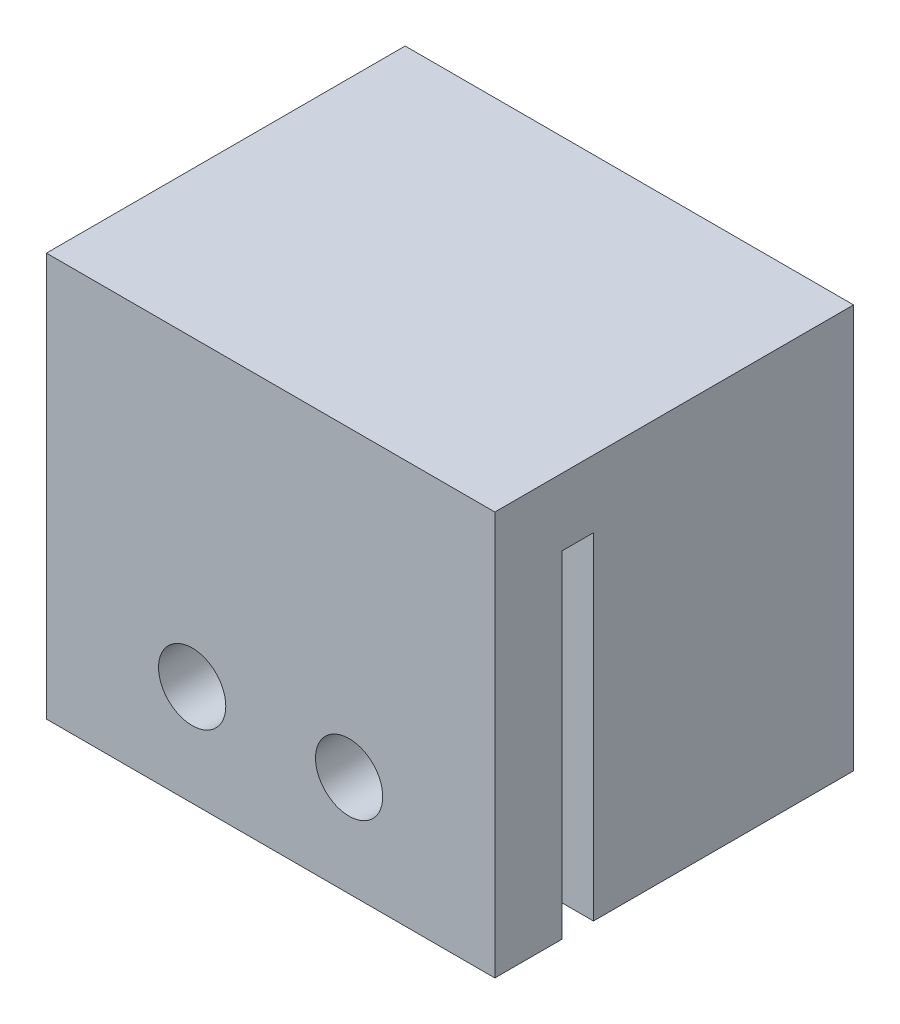
ISO-10303-21;
HEADER;
FILE_DESCRIPTION(('STEP AP214'),'2;1');
FILE_NAME('part.step','',(''),(''),'','','');
FILE_SCHEMA(('AUTOMOTIVE_DESIGN { 1 0 10303 214 1 1 1 1 }'));
ENDSEC;
DATA;
#1=APPLICATION_CONTEXT('core data for automotive mechanical design processes');
#2=APPLICATION_PROTOCOL_DEFINITION('international standard','automotive_design',2000,#1);
#3=PRODUCT_CONTEXT('',#1,'mechanical');
#4=PRODUCT('Part','Part','',(#3));
#5=PRODUCT_RELATED_PRODUCT_CATEGORY('part','',(#4));
#6=PRODUCT_DEFINITION_FORMATION('','',#4);
#7=PRODUCT_DEFINITION_CONTEXT('part definition',#1,'design');
#8=PRODUCT_DEFINITION('design','',#6,#7);
#9=PRODUCT_DEFINITION_SHAPE('','',#8);
#10=(LENGTH_UNIT() NAMED_UNIT(*) SI_UNIT(.MILLI.,.METRE.));
#11=(NAMED_UNIT(*) PLANE_ANGLE_UNIT() SI_UNIT($,.RADIAN.));
#12=(NAMED_UNIT(*) SI_UNIT($,.STERADIAN.) SOLID_ANGLE_UNIT());
#13=UNCERTAINTY_MEASURE_WITH_UNIT(LENGTH_MEASURE(1.E-05),#10,'distance_accuracy_value','');
#14=(GEOMETRIC_REPRESENTATION_CONTEXT(3) GLOBAL_UNCERTAINTY_ASSIGNED_CONTEXT((#13)) GLOBAL_UNIT_ASSIGNED_CONTEXT((#10,
#11,#12)) REPRESENTATION_CONTEXT('',''));
#15=CARTESIAN_POINT('',(0.,0.,0.));
#16=DIRECTION('',(0.,0.,1.));
#17=DIRECTION('',(1.,0.,0.));
#18=AXIS2_PLACEMENT_3D('',#15,#16,#17);
#19=CARTESIAN_POINT('',(-10.,-9.,-16.));
#20=DIRECTION('',(0.,-1.,0.));
#21=DIRECTION('',(0.,0.,-1.));
#22=AXIS2_PLACEMENT_3D('',#19,#20,#21);
#23=PLANE('',#22);
#24=DIRECTION('',(-1.,0.,0.));
#25=VECTOR('',#24,1.);
#26=CARTESIAN_POINT('',(-10.,-9.,-3.));
#27=LINE('',#26,#25);
#28=CARTESIAN_POINT('',(10.,-9.,-3.));
#29=VERTEX_POINT('',#28);
#30=CARTESIAN_POINT('',(-10.,-9.,-3.));
#31=VERTEX_POINT('',#30);
#32=EDGE_CURVE('E157',#29,#31,#27,.T.);
#33=ORIENTED_EDGE('',*,*,#32,.F.);
#34=DIRECTION('',(0.,0.,1.));
#35=VECTOR('',#34,1.);
#36=CARTESIAN_POINT('',(10.,-9.,-16.));
#37=LINE('',#36,#35);
#38=CARTESIAN_POINT('',(10.,-9.,0.));
#39=VERTEX_POINT('',#38);
#40=EDGE_CURVE('E43',#29,#39,#37,.T.);
#41=ORIENTED_EDGE('',*,*,#40,.T.);
#42=DIRECTION('',(1.,0.,0.));
#43=VECTOR('',#42,1.);
#44=CARTESIAN_POINT('',(-10.,-9.,0.));
#45=LINE('',#44,#43);
#46=CARTESIAN_POINT('',(-10.,-9.,0.));
#47=VERTEX_POINT('',#46);
#48=EDGE_CURVE('E198',#47,#39,#45,.T.);
#49=ORIENTED_EDGE('',*,*,#48,.F.);
#50=DIRECTION('',(0.,0.,1.));
#51=VECTOR('',#50,1.);
#52=CARTESIAN_POINT('',(-10.,-9.,-16.));
#53=LINE('',#52,#51);
#54=EDGE_CURVE('E216',#31,#47,#53,.T.);
#55=ORIENTED_EDGE('',*,*,#54,.F.);
#56=EDGE_LOOP('',(#33,#41,#49,#55));
#57=FACE_BOUND('',#56,.T.);
#58=ADVANCED_FACE('F34',(#57),#23,.T.);
#59=DIRECTION('',(1.,0.,0.));
#60=VECTOR('',#59,1.);
#61=CARTESIAN_POINT('',(-10.,-9.,-4.4));
#62=LINE('',#61,#60);
#63=CARTESIAN_POINT('',(-10.,-9.,-4.4));
#64=VERTEX_POINT('',#63);
#65=CARTESIAN_POINT('',(-7.05,-9.,-4.4));
#66=VERTEX_POINT('',#65);
#67=EDGE_CURVE('E225',#64,#66,#62,.T.);
#68=ORIENTED_EDGE('',*,*,#67,.F.);
#69=CARTESIAN_POINT('',(-10.,-9.,-16.));
#70=VERTEX_POINT('',#69);
#71=EDGE_CURVE('E162',#70,#64,#53,.T.);
#72=ORIENTED_EDGE('',*,*,#71,.F.);
#73=DIRECTION('',(1.,0.,0.));
#74=VECTOR('',#73,1.);
#75=CARTESIAN_POINT('',(-10.,-9.,-16.));
#76=LINE('',#75,#74);
#77=CARTESIAN_POINT('',(-7.05,-9.,-16.));
#78=VERTEX_POINT('',#77);
#79=EDGE_CURVE('E202',#70,#78,#76,.T.);
#80=ORIENTED_EDGE('',*,*,#79,.T.);
#81=DIRECTION('',(0.,0.,-1.));
#82=VECTOR('',#81,1.);
#83=CARTESIAN_POINT('',(-7.05,-9.,-16.));
#84=LINE('',#83,#82);
#85=EDGE_CURVE('E179',#66,#78,#84,.T.);
#86=ORIENTED_EDGE('',*,*,#85,.F.);
#87=EDGE_LOOP('',(#68,#72,#80,#86));
#88=FACE_BOUND('',#87,.T.);
#89=ADVANCED_FACE('F260',(#88),#23,.T.);
#90=CARTESIAN_POINT('',(10.,-9.,-16.));
#91=DIRECTION('',(1.,0.,0.));
#92=DIRECTION('',(0.,0.,-1.));
#93=AXIS2_PLACEMENT_3D('',#90,#91,#92);
#94=PLANE('',#93);
#95=DIRECTION('',(0.,-1.,0.));
#96=VECTOR('',#95,1.);
#97=CARTESIAN_POINT('',(10.,6.,-3.));
#98=LINE('',#97,#96);
#99=CARTESIAN_POINT('',(10.,6.,-3.));
#100=VERTEX_POINT('',#99);
#101=EDGE_CURVE('E164',#100,#29,#98,.T.);
#102=ORIENTED_EDGE('',*,*,#101,.F.);
#103=DIRECTION('',(0.,0.,1.));
#104=VECTOR('',#103,1.);
#105=CARTESIAN_POINT('',(10.,6.,-3.));
#106=LINE('',#105,#104);
#107=CARTESIAN_POINT('',(10.,6.,-4.4));
#108=VERTEX_POINT('',#107);
#109=EDGE_CURVE('E147',#108,#100,#106,.T.);
#110=ORIENTED_EDGE('',*,*,#109,.F.);
#111=DIRECTION('',(0.,-1.,0.));
#112=VECTOR('',#111,1.);
#113=CARTESIAN_POINT('',(10.,6.,-4.4));
#114=LINE('',#113,#112);
#115=CARTESIAN_POINT('',(10.,-9.,-4.4));
#116=VERTEX_POINT('',#115);
#117=EDGE_CURVE('E144',#108,#116,#114,.T.);
#118=ORIENTED_EDGE('',*,*,#117,.T.);
#119=CARTESIAN_POINT('',(10.,-9.,-16.));
#120=VERTEX_POINT('',#119);
#121=EDGE_CURVE('E11',#120,#116,#37,.T.);
#122=ORIENTED_EDGE('',*,*,#121,.F.);
#123=DIRECTION('',(0.,1.,0.));
#124=VECTOR('',#123,1.);
#125=CARTESIAN_POINT('',(10.,-9.,-16.));
#126=LINE('',#125,#124);
#127=CARTESIAN_POINT('',(10.,9.,-16.));
#128=VERTEX_POINT('',#127);
#129=EDGE_CURVE('E194',#120,#128,#126,.T.);
#130=ORIENTED_EDGE('',*,*,#129,.T.);
#131=DIRECTION('',(0.,0.,1.));
#132=VECTOR('',#131,1.);
#133=CARTESIAN_POINT('',(10.,9.,-16.));
#134=LINE('',#133,#132);
#135=CARTESIAN_POINT('',(10.,9.,0.));
#136=VERTEX_POINT('',#135);
#137=EDGE_CURVE('E88',#128,#136,#134,.T.);
#138=ORIENTED_EDGE('',*,*,#137,.T.);
#139=DIRECTION('',(0.,1.,0.));
#140=VECTOR('',#139,1.);
#141=CARTESIAN_POINT('',(10.,-9.,0.));
#142=LINE('',#141,#140);
#143=EDGE_CURVE('E187',#39,#136,#142,.T.);
#144=ORIENTED_EDGE('',*,*,#143,.F.);
#145=ORIENTED_EDGE('',*,*,#40,.F.);
#146=EDGE_LOOP('',(#102,#110,#118,#122,#130,#138,#144,#145));
#147=FACE_BOUND('',#146,.T.);
#148=ADVANCED_FACE('F36',(#147),#94,.T.);
#149=CARTESIAN_POINT('',(7.05,-9.,-4.4));
#150=VERTEX_POINT('',#149);
#151=EDGE_CURVE('E221',#150,#116,#62,.T.);
#152=ORIENTED_EDGE('',*,*,#151,.F.);
#153=DIRECTION('',(0.,0.,1.));
#154=VECTOR('',#153,1.);
#155=CARTESIAN_POINT('',(7.05,-9.,-16.));
#156=LINE('',#155,#154);
#157=CARTESIAN_POINT('',(7.05,-9.,-16.));
#158=VERTEX_POINT('',#157);
#159=EDGE_CURVE('E171',#158,#150,#156,.T.);
#160=ORIENTED_EDGE('',*,*,#159,.F.);
#161=EDGE_CURVE('E59',#158,#120,#76,.T.);
#162=ORIENTED_EDGE('',*,*,#161,.T.);
#163=ORIENTED_EDGE('',*,*,#121,.T.);
#164=EDGE_LOOP('',(#152,#160,#162,#163));
#165=FACE_BOUND('',#164,.T.);
#166=ADVANCED_FACE('F257',(#165),#23,.T.);
#167=CARTESIAN_POINT('',(-10.,-9.,-16.));
#168=DIRECTION('',(-1.,0.,0.));
#169=DIRECTION('',(0.,0.,1.));
#170=AXIS2_PLACEMENT_3D('',#167,#168,#169);
#171=PLANE('',#170);
#172=DIRECTION('',(0.,-1.,0.));
#173=VECTOR('',#172,1.);
#174=CARTESIAN_POINT('',(-10.,6.,-3.));
#175=LINE('',#174,#173);
#176=CARTESIAN_POINT('',(-10.,6.,-3.));
#177=VERTEX_POINT('',#176);
#178=EDGE_CURVE('E181',#177,#31,#175,.T.);
#179=ORIENTED_EDGE('',*,*,#178,.T.);
#180=ORIENTED_EDGE('',*,*,#54,.T.);
#181=DIRECTION('',(0.,-1.,0.));
#182=VECTOR('',#181,1.);
#183=CARTESIAN_POINT('',(-10.,-9.,0.));
#184=LINE('',#183,#182);
#185=CARTESIAN_POINT('',(-10.,9.,0.));
#186=VERTEX_POINT('',#185);
#187=EDGE_CURVE('E210',#186,#47,#184,.T.);
#188=ORIENTED_EDGE('',*,*,#187,.F.);
#189=DIRECTION('',(0.,0.,1.));
#190=VECTOR('',#189,1.);
#191=CARTESIAN_POINT('',(-10.,9.,-16.));
#192=LINE('',#191,#190);
#193=CARTESIAN_POINT('',(-10.,9.,-16.));
#194=VERTEX_POINT('',#193);
#195=EDGE_CURVE('E217',#194,#186,#192,.T.);
#196=ORIENTED_EDGE('',*,*,#195,.F.);
#197=DIRECTION('',(0.,-1.,0.));
#198=VECTOR('',#197,1.);
#199=CARTESIAN_POINT('',(-10.,-9.,-16.));
#200=LINE('',#199,#198);
#201=EDGE_CURVE('E200',#194,#70,#200,.T.);
#202=ORIENTED_EDGE('',*,*,#201,.T.);
#203=ORIENTED_EDGE('',*,*,#71,.T.);
#204=DIRECTION('',(0.,-1.,0.));
#205=VECTOR('',#204,1.);
#206=CARTESIAN_POINT('',(-10.,6.,-4.4));
#207=LINE('',#206,#205);
#208=CARTESIAN_POINT('',(-10.,6.,-4.4));
#209=VERTEX_POINT('',#208);
#210=EDGE_CURVE('E141',#209,#64,#207,.T.);
#211=ORIENTED_EDGE('',*,*,#210,.F.);
#212=DIRECTION('',(0.,0.,-1.));
#213=VECTOR('',#212,1.);
#214=CARTESIAN_POINT('',(-10.,6.,-3.));
#215=LINE('',#214,#213);
#216=EDGE_CURVE('E148',#177,#209,#215,.T.);
#217=ORIENTED_EDGE('',*,*,#216,.F.);
#218=EDGE_LOOP('',(#179,#180,#188,#196,#202,#203,#211,#217));
#219=FACE_BOUND('',#218,.T.);
#220=ADVANCED_FACE('F160',(#219),#171,.T.);
#221=CARTESIAN_POINT('',(-10.,9.,-16.));
#222=DIRECTION('',(0.,1.,0.));
#223=DIRECTION('',(0.,0.,1.));
#224=AXIS2_PLACEMENT_3D('',#221,#222,#223);
#225=PLANE('',#224);
#226=DIRECTION('',(-1.,0.,0.));
#227=VECTOR('',#226,1.);
#228=CARTESIAN_POINT('',(-10.,9.,0.));
#229=LINE('',#228,#227);
#230=EDGE_CURVE('E207',#136,#186,#229,.T.);
#231=ORIENTED_EDGE('',*,*,#230,.F.);
#232=ORIENTED_EDGE('',*,*,#137,.F.);
#233=DIRECTION('',(-1.,0.,0.));
#234=VECTOR('',#233,1.);
#235=CARTESIAN_POINT('',(-10.,9.,-16.));
#236=LINE('',#235,#234);
#237=EDGE_CURVE('E197',#128,#194,#236,.T.);
#238=ORIENTED_EDGE('',*,*,#237,.T.);
#239=ORIENTED_EDGE('',*,*,#195,.T.);
#240=EDGE_LOOP('',(#231,#232,#238,#239));
#241=FACE_BOUND('',#240,.T.);
#242=ADVANCED_FACE('F250',(#241),#225,.T.);
#243=CARTESIAN_POINT('',(0.,0.,-16.));
#244=DIRECTION('',(0.,0.,-1.));
#245=DIRECTION('',(-1.,0.,0.));
#246=AXIS2_PLACEMENT_3D('',#243,#244,#245);
#247=PLANE('',#246);
#248=DIRECTION('',(0.,-1.,0.));
#249=VECTOR('',#248,1.);
#250=CARTESIAN_POINT('',(-7.05,0.0499999999999997,-16.));
#251=LINE('',#250,#249);
#252=CARTESIAN_POINT('',(-7.05,0.0499999999999997,-16.));
#253=VERTEX_POINT('',#252);
#254=EDGE_CURVE('E178',#253,#78,#251,.T.);
#255=ORIENTED_EDGE('',*,*,#254,.T.);
#256=ORIENTED_EDGE('',*,*,#79,.F.);
#257=ORIENTED_EDGE('',*,*,#201,.F.);
#258=ORIENTED_EDGE('',*,*,#237,.F.);
#259=ORIENTED_EDGE('',*,*,#129,.F.);
#260=ORIENTED_EDGE('',*,*,#161,.F.);
#261=DIRECTION('',(0.,-1.,0.));
#262=VECTOR('',#261,1.);
#263=CARTESIAN_POINT('',(7.05,0.0499999999999997,-16.));
#264=LINE('',#263,#262);
#265=CARTESIAN_POINT('',(7.05,0.0499999999999997,-16.));
#266=VERTEX_POINT('',#265);
#267=EDGE_CURVE('E190',#266,#158,#264,.T.);
#268=ORIENTED_EDGE('',*,*,#267,.F.);
#269=DIRECTION('',(1.,0.,0.));
#270=VECTOR('',#269,1.);
#271=CARTESIAN_POINT('',(-7.05,0.0499999999999997,-16.));
#272=LINE('',#271,#270);
#273=EDGE_CURVE('E170',#253,#266,#272,.T.);
#274=ORIENTED_EDGE('',*,*,#273,.F.);
#275=EDGE_LOOP('',(#255,#256,#257,#258,#259,#260,#268,#274));
#276=FACE_BOUND('',#275,.T.);
#277=ADVANCED_FACE('F248',(#276),#247,.T.);
#278=CARTESIAN_POINT('',(0.,0.,0.));
#279=DIRECTION('',(0.,0.,-1.));
#280=DIRECTION('',(-1.,0.,0.));
#281=AXIS2_PLACEMENT_3D('',#278,#279,#280);
#282=PLANE('',#281);
#283=CARTESIAN_POINT('',(3.5,-4.50000000000001,0.));
#284=DIRECTION('',(0.,0.,1.));
#285=DIRECTION('',(1.,0.,0.));
#286=AXIS2_PLACEMENT_3D('',#283,#284,#285);
#287=CIRCLE('',#286,1.5);
#288=CARTESIAN_POINT('',(5.,-4.50000000000001,0.));
#289=VERTEX_POINT('',#288);
#290=EDGE_CURVE('E232',#289,#289,#287,.T.);
#291=ORIENTED_EDGE('',*,*,#290,.F.);
#292=EDGE_LOOP('',(#291));
#293=FACE_BOUND('',#292,.T.);
#294=CARTESIAN_POINT('',(-3.5,-4.50000000000001,0.));
#295=DIRECTION('',(0.,0.,1.));
#296=DIRECTION('',(1.,0.,0.));
#297=AXIS2_PLACEMENT_3D('',#294,#295,#296);
#298=CIRCLE('',#297,1.5);
#299=CARTESIAN_POINT('',(-2.,-4.50000000000001,0.));
#300=VERTEX_POINT('',#299);
#301=EDGE_CURVE('E222',#300,#300,#298,.T.);
#302=ORIENTED_EDGE('',*,*,#301,.F.);
#303=EDGE_LOOP('',(#302));
#304=FACE_BOUND('',#303,.T.);
#305=ORIENTED_EDGE('',*,*,#143,.T.);
#306=ORIENTED_EDGE('',*,*,#230,.T.);
#307=ORIENTED_EDGE('',*,*,#187,.T.);
#308=ORIENTED_EDGE('',*,*,#48,.T.);
#309=EDGE_LOOP('',(#305,#306,#307,#308));
#310=FACE_BOUND('',#309,.T.);
#311=ADVANCED_FACE('F243',(#293,#304,#310),#282,.F.);
#312=CARTESIAN_POINT('',(-7.05,0.0499999999999997,-16.));
#313=DIRECTION('',(-1.,0.,0.));
#314=DIRECTION('',(0.,0.,1.));
#315=AXIS2_PLACEMENT_3D('',#312,#313,#314);
#316=PLANE('',#315);
#317=ORIENTED_EDGE('',*,*,#85,.T.);
#318=ORIENTED_EDGE('',*,*,#254,.F.);
#319=DIRECTION('',(0.,0.,-1.));
#320=VECTOR('',#319,1.);
#321=CARTESIAN_POINT('',(-7.05,0.0499999999999997,-16.));
#322=LINE('',#321,#320);
#323=CARTESIAN_POINT('',(-7.05,0.0499999999999997,-4.4));
#324=VERTEX_POINT('',#323);
#325=EDGE_CURVE('E51',#324,#253,#322,.T.);
#326=ORIENTED_EDGE('',*,*,#325,.F.);
#327=DIRECTION('',(0.,-1.,0.));
#328=VECTOR('',#327,1.);
#329=CARTESIAN_POINT('',(-7.05,0.0499999999999997,-4.4));
#330=LINE('',#329,#328);
#331=EDGE_CURVE('E184',#324,#66,#330,.T.);
#332=ORIENTED_EDGE('',*,*,#331,.T.);
#333=EDGE_LOOP('',(#317,#318,#326,#332));
#334=FACE_BOUND('',#333,.T.);
#335=ADVANCED_FACE('F280',(#334),#316,.F.);
#336=CARTESIAN_POINT('',(7.05,0.0499999999999997,-16.));
#337=DIRECTION('',(1.,0.,0.));
#338=DIRECTION('',(0.,0.,-1.));
#339=AXIS2_PLACEMENT_3D('',#336,#337,#338);
#340=PLANE('',#339);
#341=ORIENTED_EDGE('',*,*,#159,.T.);
#342=DIRECTION('',(0.,-1.,0.));
#343=VECTOR('',#342,1.);
#344=CARTESIAN_POINT('',(7.05,0.0499999999999997,-4.4));
#345=LINE('',#344,#343);
#346=CARTESIAN_POINT('',(7.05,0.0499999999999997,-4.4));
#347=VERTEX_POINT('',#346);
#348=EDGE_CURVE('E188',#347,#150,#345,.T.);
#349=ORIENTED_EDGE('',*,*,#348,.F.);
#350=DIRECTION('',(0.,0.,1.));
#351=VECTOR('',#350,1.);
#352=CARTESIAN_POINT('',(7.05,0.0499999999999997,-16.));
#353=LINE('',#352,#351);
#354=EDGE_CURVE('E173',#266,#347,#353,.T.);
#355=ORIENTED_EDGE('',*,*,#354,.F.);
#356=ORIENTED_EDGE('',*,*,#267,.T.);
#357=EDGE_LOOP('',(#341,#349,#355,#356));
#358=FACE_BOUND('',#357,.T.);
#359=ADVANCED_FACE('F274',(#358),#340,.F.);
#360=CARTESIAN_POINT('',(0.,0.0499999999999997,0.));
#361=DIRECTION('',(0.,1.,0.));
#362=DIRECTION('',(0.,0.,1.));
#363=AXIS2_PLACEMENT_3D('',#360,#361,#362);
#364=PLANE('',#363);
#365=ORIENTED_EDGE('',*,*,#325,.T.);
#366=ORIENTED_EDGE('',*,*,#273,.T.);
#367=ORIENTED_EDGE('',*,*,#354,.T.);
#368=DIRECTION('',(-1.,0.,0.));
#369=VECTOR('',#368,1.);
#370=CARTESIAN_POINT('',(-7.05,0.0499999999999997,-4.4));
#371=LINE('',#370,#369);
#372=EDGE_CURVE('E176',#347,#324,#371,.T.);
#373=ORIENTED_EDGE('',*,*,#372,.T.);
#374=EDGE_LOOP('',(#365,#366,#367,#373));
#375=FACE_BOUND('',#374,.T.);
#376=ADVANCED_FACE('F277',(#375),#364,.F.);
#377=CARTESIAN_POINT('',(-10.,6.,-4.4));
#378=DIRECTION('',(0.,0.,-1.));
#379=DIRECTION('',(-1.,0.,0.));
#380=AXIS2_PLACEMENT_3D('',#377,#378,#379);
#381=PLANE('',#380);
#382=ORIENTED_EDGE('',*,*,#372,.F.);
#383=ORIENTED_EDGE('',*,*,#348,.T.);
#384=ORIENTED_EDGE('',*,*,#151,.T.);
#385=ORIENTED_EDGE('',*,*,#117,.F.);
#386=DIRECTION('',(1.,0.,0.));
#387=VECTOR('',#386,1.);
#388=CARTESIAN_POINT('',(-10.,6.,-4.4));
#389=LINE('',#388,#387);
#390=EDGE_CURVE('E137',#209,#108,#389,.T.);
#391=ORIENTED_EDGE('',*,*,#390,.F.);
#392=ORIENTED_EDGE('',*,*,#210,.T.);
#393=ORIENTED_EDGE('',*,*,#67,.T.);
#394=ORIENTED_EDGE('',*,*,#331,.F.);
#395=EDGE_LOOP('',(#382,#383,#384,#385,#391,#392,#393,#394));
#396=FACE_BOUND('',#395,.T.);
#397=ADVANCED_FACE('F139',(#396),#381,.F.);
#398=CARTESIAN_POINT('',(-10.,6.,-3.));
#399=DIRECTION('',(0.,0.,1.));
#400=DIRECTION('',(1.,0.,0.));
#401=AXIS2_PLACEMENT_3D('',#398,#399,#400);
#402=PLANE('',#401);
#403=CARTESIAN_POINT('',(3.5,-4.50000000000001,-3.));
#404=DIRECTION('',(0.,0.,1.));
#405=DIRECTION('',(1.,0.,0.));
#406=AXIS2_PLACEMENT_3D('',#403,#404,#405);
#407=CIRCLE('',#406,1.5);
#408=CARTESIAN_POINT('',(5.,-4.50000000000001,-3.));
#409=VERTEX_POINT('',#408);
#410=EDGE_CURVE('E38',#409,#409,#407,.T.);
#411=ORIENTED_EDGE('',*,*,#410,.T.);
#412=EDGE_LOOP('',(#411));
#413=FACE_BOUND('',#412,.T.);
#414=CARTESIAN_POINT('',(-3.5,-4.50000000000001,-3.));
#415=DIRECTION('',(0.,0.,1.));
#416=DIRECTION('',(1.,0.,0.));
#417=AXIS2_PLACEMENT_3D('',#414,#415,#416);
#418=CIRCLE('',#417,1.5);
#419=CARTESIAN_POINT('',(-2.,-4.50000000000001,-3.));
#420=VERTEX_POINT('',#419);
#421=EDGE_CURVE('E219',#420,#420,#418,.T.);
#422=ORIENTED_EDGE('',*,*,#421,.T.);
#423=EDGE_LOOP('',(#422));
#424=FACE_BOUND('',#423,.T.);
#425=ORIENTED_EDGE('',*,*,#32,.T.);
#426=ORIENTED_EDGE('',*,*,#178,.F.);
#427=DIRECTION('',(-1.,0.,0.));
#428=VECTOR('',#427,1.);
#429=CARTESIAN_POINT('',(-10.,6.,-3.));
#430=LINE('',#429,#428);
#431=EDGE_CURVE('E154',#100,#177,#430,.T.);
#432=ORIENTED_EDGE('',*,*,#431,.F.);
#433=ORIENTED_EDGE('',*,*,#101,.T.);
#434=EDGE_LOOP('',(#425,#426,#432,#433));
#435=FACE_BOUND('',#434,.T.);
#436=ADVANCED_FACE('F239',(#413,#424,#435),#402,.F.);
#437=CARTESIAN_POINT('',(0.,6.,0.));
#438=DIRECTION('',(0.,-1.,0.));
#439=DIRECTION('',(0.,0.,-1.));
#440=AXIS2_PLACEMENT_3D('',#437,#438,#439);
#441=PLANE('',#440);
#442=ORIENTED_EDGE('',*,*,#216,.T.);
#443=ORIENTED_EDGE('',*,*,#390,.T.);
#444=ORIENTED_EDGE('',*,*,#109,.T.);
#445=ORIENTED_EDGE('',*,*,#431,.T.);
#446=EDGE_LOOP('',(#442,#443,#444,#445));
#447=FACE_BOUND('',#446,.T.);
#448=ADVANCED_FACE('F152',(#447),#441,.T.);
#449=CARTESIAN_POINT('',(-3.5,-4.50000000000001,-16.));
#450=DIRECTION('',(0.,0.,1.));
#451=DIRECTION('',(1.,0.,0.));
#452=AXIS2_PLACEMENT_3D('',#449,#450,#451);
#453=CYLINDRICAL_SURFACE('',#452,1.5);
#454=ORIENTED_EDGE('',*,*,#301,.T.);
#455=EDGE_LOOP('',(#454));
#456=FACE_BOUND('',#455,.T.);
#457=ORIENTED_EDGE('',*,*,#421,.F.);
#458=EDGE_LOOP('',(#457));
#459=FACE_BOUND('',#458,.T.);
#460=ADVANCED_FACE('F299',(#456,#459),#453,.F.);
#461=CARTESIAN_POINT('',(3.5,-4.50000000000001,-16.));
#462=DIRECTION('',(0.,0.,1.));
#463=DIRECTION('',(1.,0.,0.));
#464=AXIS2_PLACEMENT_3D('',#461,#462,#463);
#465=CYLINDRICAL_SURFACE('',#464,1.5);
#466=ORIENTED_EDGE('',*,*,#290,.T.);
#467=EDGE_LOOP('',(#466));
#468=FACE_BOUND('',#467,.T.);
#469=ORIENTED_EDGE('',*,*,#410,.F.);
#470=EDGE_LOOP('',(#469));
#471=FACE_BOUND('',#470,.T.);
#472=ADVANCED_FACE('F302',(#468,#471),#465,.F.);
#473=CLOSED_SHELL('',(#58,#89,#148,#166,#220,#242,#277,#311,#335,#359,#376,#397,#436,#448,#460,#472));
#474=MANIFOLD_SOLID_BREP('B2',#473);
#475=ADVANCED_BREP_SHAPE_REPRESENTATION('',(#18,#474),#14);
#476=SHAPE_DEFINITION_REPRESENTATION(#9,#475);
ENDSEC;
END-ISO-10303-21;
